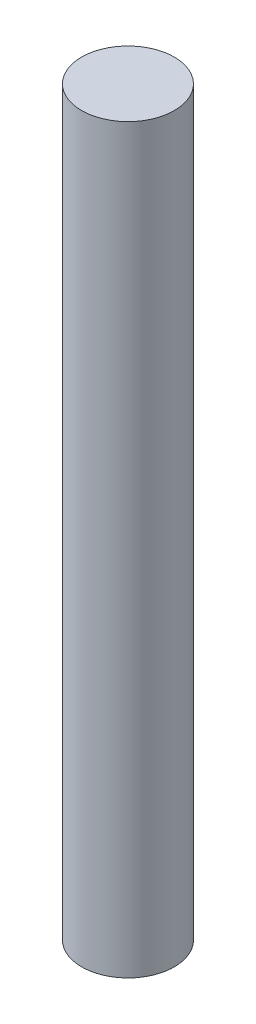
ISO-10303-21;
HEADER;
FILE_DESCRIPTION(('STEP AP214'),'2;1');
FILE_NAME('part.step','',(''),(''),'','','');
FILE_SCHEMA(('AUTOMOTIVE_DESIGN { 1 0 10303 214 1 1 1 1 }'));
ENDSEC;
DATA;
#1=APPLICATION_CONTEXT('core data for automotive mechanical design processes');
#2=APPLICATION_PROTOCOL_DEFINITION('international standard','automotive_design',2000,#1);
#3=PRODUCT_CONTEXT('',#1,'mechanical');
#4=PRODUCT('Part','Part','',(#3));
#5=PRODUCT_RELATED_PRODUCT_CATEGORY('part','',(#4));
#6=PRODUCT_DEFINITION_FORMATION('','',#4);
#7=PRODUCT_DEFINITION_CONTEXT('part definition',#1,'design');
#8=PRODUCT_DEFINITION('design','',#6,#7);
#9=PRODUCT_DEFINITION_SHAPE('','',#8);
#10=(LENGTH_UNIT() NAMED_UNIT(*) SI_UNIT(.MILLI.,.METRE.));
#11=(NAMED_UNIT(*) PLANE_ANGLE_UNIT() SI_UNIT($,.RADIAN.));
#12=(NAMED_UNIT(*) SI_UNIT($,.STERADIAN.) SOLID_ANGLE_UNIT());
#13=UNCERTAINTY_MEASURE_WITH_UNIT(LENGTH_MEASURE(1.E-05),#10,'distance_accuracy_value','');
#14=(GEOMETRIC_REPRESENTATION_CONTEXT(3) GLOBAL_UNCERTAINTY_ASSIGNED_CONTEXT((#13)) GLOBAL_UNIT_ASSIGNED_CONTEXT((#10,
#11,#12)) REPRESENTATION_CONTEXT('',''));
#15=CARTESIAN_POINT('',(0.,0.,0.));
#16=DIRECTION('',(0.,0.,1.));
#17=DIRECTION('',(1.,0.,0.));
#18=AXIS2_PLACEMENT_3D('',#15,#16,#17);
#19=CARTESIAN_POINT('',(0.,76.2,0.));
#20=DIRECTION('',(0.,-0.999999999999994,0.));
#21=DIRECTION('',(1.,0.,0.));
#22=AXIS2_PLACEMENT_3D('',#19,#20,#21);
#23=PLANE('',#22);
#24=CARTESIAN_POINT('',(0.,76.2,0.));
#25=DIRECTION('',(0.,0.999999999999994,0.));
#26=DIRECTION('',(-1.,0.,0.));
#27=AXIS2_PLACEMENT_3D('',#24,#25,#26);
#28=CIRCLE('',#27,9.525);
#29=CARTESIAN_POINT('',(-9.525,76.2,0.));
#30=VERTEX_POINT('',#29);
#31=EDGE_CURVE('E10',#30,#30,#28,.T.);
#32=ORIENTED_EDGE('',*,*,#31,.T.);
#33=EDGE_LOOP('',(#32));
#34=FACE_BOUND('',#33,.T.);
#35=ADVANCED_FACE('F40',(#34),#23,.F.);
#36=CARTESIAN_POINT('',(-2.22044604925031E-13,101.6,0.));
#37=DIRECTION('',(0.,0.999999999999994,0.));
#38=DIRECTION('',(-1.,0.,0.));
#39=AXIS2_PLACEMENT_3D('',#36,#37,#38);
#40=CYLINDRICAL_SURFACE('',#39,9.52500000000001);
#41=ORIENTED_EDGE('',*,*,#31,.F.);
#42=EDGE_LOOP('',(#41));
#43=FACE_BOUND('',#42,.T.);
#44=CARTESIAN_POINT('',(0.,-76.2,0.));
#45=DIRECTION('',(0.,0.999999999999994,0.));
#46=DIRECTION('',(-1.,0.,0.));
#47=AXIS2_PLACEMENT_3D('',#44,#45,#46);
#48=CIRCLE('',#47,9.52500000000002);
#49=CARTESIAN_POINT('',(-9.52500000000002,-76.2,0.));
#50=VERTEX_POINT('',#49);
#51=EDGE_CURVE('E47',#50,#50,#48,.T.);
#52=ORIENTED_EDGE('',*,*,#51,.T.);
#53=EDGE_LOOP('',(#52));
#54=FACE_BOUND('',#53,.T.);
#55=ADVANCED_FACE('F56',(#43,#54),#40,.T.);
#56=CARTESIAN_POINT('',(9.52500000000006,-76.2,0.));
#57=DIRECTION('',(0.,0.999999999999994,0.));
#58=DIRECTION('',(-1.,0.,0.));
#59=AXIS2_PLACEMENT_3D('',#56,#57,#58);
#60=PLANE('',#59);
#61=ORIENTED_EDGE('',*,*,#51,.F.);
#62=EDGE_LOOP('',(#61));
#63=FACE_BOUND('',#62,.T.);
#64=ADVANCED_FACE('F58',(#63),#60,.F.);
#65=CLOSED_SHELL('',(#35,#55,#64));
#66=MANIFOLD_SOLID_BREP('B2',#65);
#67=ADVANCED_BREP_SHAPE_REPRESENTATION('',(#18,#66),#14);
#68=SHAPE_DEFINITION_REPRESENTATION(#9,#67);
ENDSEC;
END-ISO-10303-21;
